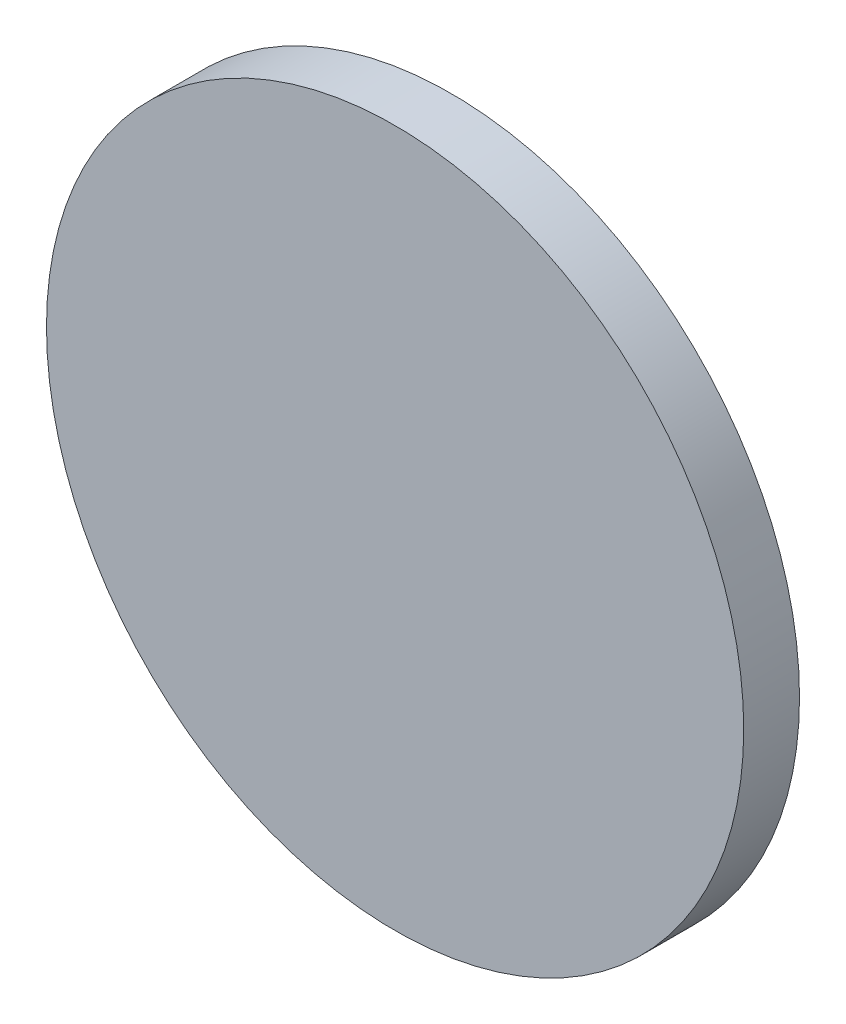
ISO-10303-21;
HEADER;
FILE_DESCRIPTION(('STEP AP214'),'2;1');
FILE_NAME('part.step','',(''),(''),'','','');
FILE_SCHEMA(('AUTOMOTIVE_DESIGN { 1 0 10303 214 1 1 1 1 }'));
ENDSEC;
DATA;
#1=APPLICATION_CONTEXT('core data for automotive mechanical design processes');
#2=APPLICATION_PROTOCOL_DEFINITION('international standard','automotive_design',2000,#1);
#3=PRODUCT_CONTEXT('',#1,'mechanical');
#4=PRODUCT('Part','Part','',(#3));
#5=PRODUCT_RELATED_PRODUCT_CATEGORY('part','',(#4));
#6=PRODUCT_DEFINITION_FORMATION('','',#4);
#7=PRODUCT_DEFINITION_CONTEXT('part definition',#1,'design');
#8=PRODUCT_DEFINITION('design','',#6,#7);
#9=PRODUCT_DEFINITION_SHAPE('','',#8);
#10=(LENGTH_UNIT() NAMED_UNIT(*) SI_UNIT(.MILLI.,.METRE.));
#11=(NAMED_UNIT(*) PLANE_ANGLE_UNIT() SI_UNIT($,.RADIAN.));
#12=(NAMED_UNIT(*) SI_UNIT($,.STERADIAN.) SOLID_ANGLE_UNIT());
#13=UNCERTAINTY_MEASURE_WITH_UNIT(LENGTH_MEASURE(1.E-05),#10,'distance_accuracy_value','');
#14=(GEOMETRIC_REPRESENTATION_CONTEXT(3) GLOBAL_UNCERTAINTY_ASSIGNED_CONTEXT((#13)) GLOBAL_UNIT_ASSIGNED_CONTEXT((#10,
#11,#12)) REPRESENTATION_CONTEXT('',''));
#15=CARTESIAN_POINT('',(0.,0.,0.));
#16=DIRECTION('',(0.,0.,1.));
#17=DIRECTION('',(1.,0.,0.));
#18=AXIS2_PLACEMENT_3D('',#15,#16,#17);
#19=CARTESIAN_POINT('',(0.,0.,2.));
#20=DIRECTION('',(0.,0.,-1.));
#21=DIRECTION('',(-1.,0.,0.));
#22=AXIS2_PLACEMENT_3D('',#19,#20,#21);
#23=CYLINDRICAL_SURFACE('',#22,12.5);
#24=CARTESIAN_POINT('',(0.,0.,2.));
#25=DIRECTION('',(0.,0.,1.));
#26=DIRECTION('',(1.,0.,0.));
#27=AXIS2_PLACEMENT_3D('',#24,#25,#26);
#28=CIRCLE('',#27,12.5);
#29=CARTESIAN_POINT('',(12.5,0.,2.));
#30=VERTEX_POINT('',#29);
#31=EDGE_CURVE('E10',#30,#30,#28,.T.);
#32=ORIENTED_EDGE('',*,*,#31,.F.);
#33=EDGE_LOOP('',(#32));
#34=FACE_BOUND('',#33,.T.);
#35=CARTESIAN_POINT('',(0.,0.,0.));
#36=DIRECTION('',(0.,0.,1.));
#37=DIRECTION('',(1.,0.,0.));
#38=AXIS2_PLACEMENT_3D('',#35,#36,#37);
#39=CIRCLE('',#38,12.5);
#40=CARTESIAN_POINT('',(12.5,0.,0.));
#41=VERTEX_POINT('',#40);
#42=EDGE_CURVE('E40',#41,#41,#39,.T.);
#43=ORIENTED_EDGE('',*,*,#42,.T.);
#44=EDGE_LOOP('',(#43));
#45=FACE_BOUND('',#44,.T.);
#46=ADVANCED_FACE('F37',(#34,#45),#23,.T.);
#47=CARTESIAN_POINT('',(0.,0.,2.));
#48=DIRECTION('',(0.,0.,1.));
#49=DIRECTION('',(1.,0.,0.));
#50=AXIS2_PLACEMENT_3D('',#47,#48,#49);
#51=PLANE('',#50);
#52=ORIENTED_EDGE('',*,*,#31,.T.);
#53=EDGE_LOOP('',(#52));
#54=FACE_BOUND('',#53,.T.);
#55=ADVANCED_FACE('F54',(#54),#51,.T.);
#56=CARTESIAN_POINT('',(0.,0.,0.));
#57=DIRECTION('',(0.,0.,1.));
#58=DIRECTION('',(1.,0.,0.));
#59=AXIS2_PLACEMENT_3D('',#56,#57,#58);
#60=PLANE('',#59);
#61=ORIENTED_EDGE('',*,*,#42,.F.);
#62=EDGE_LOOP('',(#61));
#63=FACE_BOUND('',#62,.T.);
#64=ADVANCED_FACE('F52',(#63),#60,.F.);
#65=CLOSED_SHELL('',(#46,#55,#64));
#66=MANIFOLD_SOLID_BREP('B2',#65);
#67=ADVANCED_BREP_SHAPE_REPRESENTATION('',(#18,#66),#14);
#68=SHAPE_DEFINITION_REPRESENTATION(#9,#67);
ENDSEC;
END-ISO-10303-21;
